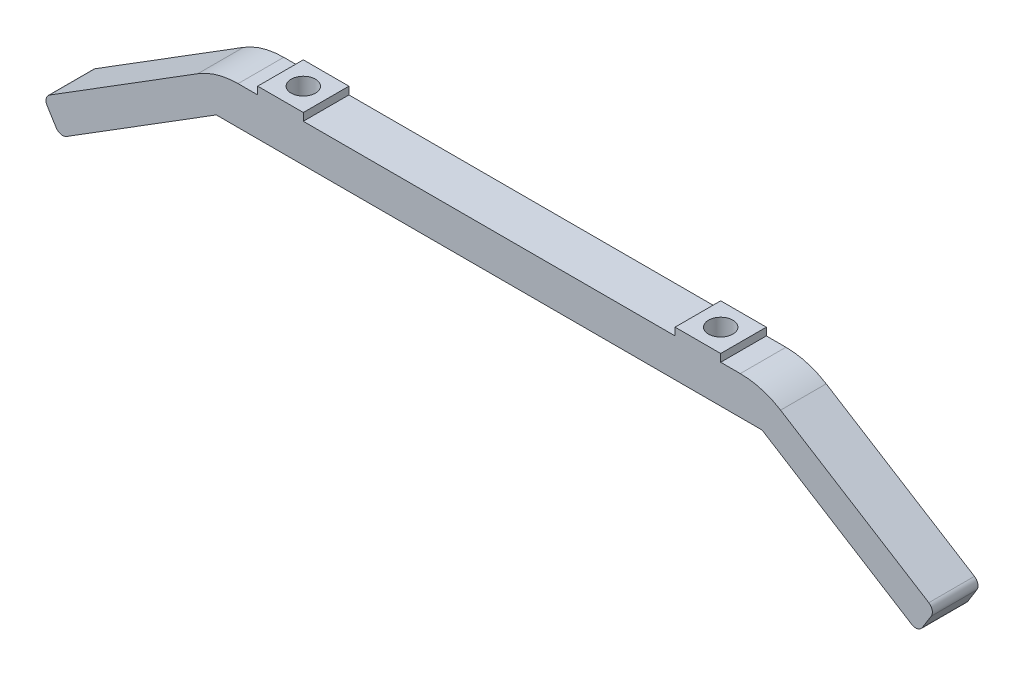
ISO-10303-21;
HEADER;
FILE_DESCRIPTION(('STEP AP214'),'2;1');
FILE_NAME('part.step','',(''),(''),'','','');
FILE_SCHEMA(('AUTOMOTIVE_DESIGN { 1 0 10303 214 1 1 1 1 }'));
ENDSEC;
DATA;
#1=APPLICATION_CONTEXT('core data for automotive mechanical design processes');
#2=APPLICATION_PROTOCOL_DEFINITION('international standard','automotive_design',2000,#1);
#3=PRODUCT_CONTEXT('',#1,'mechanical');
#4=PRODUCT('Part','Part','',(#3));
#5=PRODUCT_RELATED_PRODUCT_CATEGORY('part','',(#4));
#6=PRODUCT_DEFINITION_FORMATION('','',#4);
#7=PRODUCT_DEFINITION_CONTEXT('part definition',#1,'design');
#8=PRODUCT_DEFINITION('design','',#6,#7);
#9=PRODUCT_DEFINITION_SHAPE('','',#8);
#10=(LENGTH_UNIT() NAMED_UNIT(*) SI_UNIT(.MILLI.,.METRE.));
#11=(NAMED_UNIT(*) PLANE_ANGLE_UNIT() SI_UNIT($,.RADIAN.));
#12=(NAMED_UNIT(*) SI_UNIT($,.STERADIAN.) SOLID_ANGLE_UNIT());
#13=UNCERTAINTY_MEASURE_WITH_UNIT(LENGTH_MEASURE(1.E-05),#10,'distance_accuracy_value','');
#14=(GEOMETRIC_REPRESENTATION_CONTEXT(3) GLOBAL_UNCERTAINTY_ASSIGNED_CONTEXT((#13)) GLOBAL_UNIT_ASSIGNED_CONTEXT((#10,
#11,#12)) REPRESENTATION_CONTEXT('',''));
#15=CARTESIAN_POINT('',(0.,0.,0.));
#16=DIRECTION('',(0.,0.,1.));
#17=DIRECTION('',(1.,0.,0.));
#18=AXIS2_PLACEMENT_3D('',#15,#16,#17);
#19=CARTESIAN_POINT('',(35.8891636336118,134.664351404623,-131.106615831823));
#20=DIRECTION('',(0.529795309318727,0.848125539188554,0.));
#21=DIRECTION('',(-0.848125539188554,0.529795309318727,0.));
#22=AXIS2_PLACEMENT_3D('',#19,#20,#21);
#23=PLANE('',#22);
#24=DIRECTION('',(-0.848125539188554,0.529795309318727,0.));
#25=VECTOR('',#24,1.);
#26=CARTESIAN_POINT('',(35.8891636336118,134.664351404623,-6.43398113205662));
#27=LINE('',#26,#25);
#28=CARTESIAN_POINT('',(57.8151955530421,120.967901614889,-6.43398113205662));
#29=VERTEX_POINT('',#28);
#30=CARTESIAN_POINT('',(38.3204537318634,133.145606796509,-6.43398113205662));
#31=VERTEX_POINT('',#30);
#32=EDGE_CURVE('E223',#29,#31,#27,.T.);
#33=ORIENTED_EDGE('',*,*,#32,.F.);
#34=DIRECTION('',(0.,0.,1.));
#35=VECTOR('',#34,1.);
#36=CARTESIAN_POINT('',(57.8151955530421,120.967901614889,-131.106615831823));
#37=LINE('',#36,#35);
#38=CARTESIAN_POINT('',(57.8151955530421,120.967901614889,-12.4339811320566));
#39=VERTEX_POINT('',#38);
#40=EDGE_CURVE('E52',#29,#39,#37,.F.);
#41=ORIENTED_EDGE('',*,*,#40,.T.);
#42=DIRECTION('',(-0.848125539188554,0.529795309318727,0.));
#43=VECTOR('',#42,1.);
#44=CARTESIAN_POINT('',(35.8891636336118,134.664351404623,-12.4339811320566));
#45=LINE('',#44,#43);
#46=CARTESIAN_POINT('',(38.3204537318634,133.145606796509,-12.4339811320566));
#47=VERTEX_POINT('',#46);
#48=EDGE_CURVE('E231',#39,#47,#45,.T.);
#49=ORIENTED_EDGE('',*,*,#48,.T.);
#50=DIRECTION('',(0.,0.,1.));
#51=VECTOR('',#50,1.);
#52=CARTESIAN_POINT('',(38.3204537318634,133.145606796509,-131.106615831823));
#53=LINE('',#52,#51);
#54=EDGE_CURVE('E263',#47,#31,#53,.T.);
#55=ORIENTED_EDGE('',*,*,#54,.T.);
#56=EDGE_LOOP('',(#33,#41,#49,#55));
#57=FACE_BOUND('',#56,.T.);
#58=ADVANCED_FACE('F44',(#57),#23,.T.);
#59=CARTESIAN_POINT('',(-35.8891636336118,134.664351404623,-131.106615831823));
#60=DIRECTION('',(0.,1.,0.));
#61=DIRECTION('',(0.,0.,1.));
#62=AXIS2_PLACEMENT_3D('',#59,#60,#61);
#63=PLANE('',#62);
#64=DIRECTION('',(-1.,0.,0.));
#65=VECTOR('',#64,1.);
#66=CARTESIAN_POINT('',(-35.8891636336118,134.664351404623,-6.43398113205662));
#67=LINE('',#66,#65);
#68=CARTESIAN_POINT('',(33.0225006386761,134.664351404623,-6.43398113205662));
#69=VERTEX_POINT('',#68);
#70=CARTESIAN_POINT('',(30.4458430093025,134.664351404623,-6.43398113205662));
#71=VERTEX_POINT('',#70);
#72=EDGE_CURVE('E415',#69,#71,#67,.T.);
#73=ORIENTED_EDGE('',*,*,#72,.F.);
#74=DIRECTION('',(0.,0.,1.));
#75=VECTOR('',#74,1.);
#76=CARTESIAN_POINT('',(33.0225006386761,134.664351404623,-131.106615831823));
#77=LINE('',#76,#75);
#78=CARTESIAN_POINT('',(33.0225006386761,134.664351404623,-12.4339811320566));
#79=VERTEX_POINT('',#78);
#80=EDGE_CURVE('E266',#69,#79,#77,.F.);
#81=ORIENTED_EDGE('',*,*,#80,.T.);
#82=DIRECTION('',(-1.,0.,0.));
#83=VECTOR('',#82,1.);
#84=CARTESIAN_POINT('',(-35.8891636336118,134.664351404623,-12.4339811320566));
#85=LINE('',#84,#83);
#86=CARTESIAN_POINT('',(30.4458430093025,134.664351404623,-12.4339811320566));
#87=VERTEX_POINT('',#86);
#88=EDGE_CURVE('E244',#79,#87,#85,.T.);
#89=ORIENTED_EDGE('',*,*,#88,.T.);
#90=DIRECTION('',(0.,0.,-1.));
#91=VECTOR('',#90,1.);
#92=CARTESIAN_POINT('',(30.4458430093025,134.664351404623,-6.43398113205662));
#93=LINE('',#92,#91);
#94=EDGE_CURVE('E432',#71,#87,#93,.T.);
#95=ORIENTED_EDGE('',*,*,#94,.F.);
#96=EDGE_LOOP('',(#73,#81,#89,#95));
#97=FACE_BOUND('',#96,.T.);
#98=ADVANCED_FACE('F318',(#97),#63,.T.);
#99=CARTESIAN_POINT('',(30.4458430093025,135.664351404623,-6.43398113205662));
#100=DIRECTION('',(-1.,0.,0.));
#101=DIRECTION('',(0.,0.,1.));
#102=AXIS2_PLACEMENT_3D('',#99,#100,#101);
#103=PLANE('',#102);
#104=ORIENTED_EDGE('',*,*,#94,.T.);
#105=DIRECTION('',(0.,-1.,0.));
#106=VECTOR('',#105,1.);
#107=CARTESIAN_POINT('',(30.4458430093025,135.664351404623,-12.4339811320566));
#108=LINE('',#107,#106);
#109=CARTESIAN_POINT('',(30.4458430093025,135.664351404623,-12.4339811320566));
#110=VERTEX_POINT('',#109);
#111=EDGE_CURVE('E446',#110,#87,#108,.T.);
#112=ORIENTED_EDGE('',*,*,#111,.F.);
#113=DIRECTION('',(0.,0.,-1.));
#114=VECTOR('',#113,1.);
#115=CARTESIAN_POINT('',(30.4458430093025,135.664351404623,-6.43398113205662));
#116=LINE('',#115,#114);
#117=CARTESIAN_POINT('',(30.4458430093025,135.664351404623,-6.43398113205662));
#118=VERTEX_POINT('',#117);
#119=EDGE_CURVE('E514',#118,#110,#116,.T.);
#120=ORIENTED_EDGE('',*,*,#119,.F.);
#121=DIRECTION('',(0.,-1.,0.));
#122=VECTOR('',#121,1.);
#123=CARTESIAN_POINT('',(30.4458430093025,135.664351404623,-6.43398113205662));
#124=LINE('',#123,#122);
#125=EDGE_CURVE('E428',#118,#71,#124,.T.);
#126=ORIENTED_EDGE('',*,*,#125,.T.);
#127=EDGE_LOOP('',(#104,#112,#120,#126));
#128=FACE_BOUND('',#127,.T.);
#129=ADVANCED_FACE('F323',(#128),#103,.F.);
#130=CARTESIAN_POINT('',(24.4458430093025,135.664351404623,-6.43398113205662));
#131=DIRECTION('',(1.,0.,0.));
#132=DIRECTION('',(0.,0.,-1.));
#133=AXIS2_PLACEMENT_3D('',#130,#131,#132);
#134=PLANE('',#133);
#135=DIRECTION('',(0.,0.,1.));
#136=VECTOR('',#135,1.);
#137=CARTESIAN_POINT('',(24.4458430093025,134.664351404623,-6.43398113205662));
#138=LINE('',#137,#136);
#139=CARTESIAN_POINT('',(24.4458430093025,134.664351404623,-12.4339811320566));
#140=VERTEX_POINT('',#139);
#141=CARTESIAN_POINT('',(24.4458430093025,134.664351404623,-6.43398113205662));
#142=VERTEX_POINT('',#141);
#143=EDGE_CURVE('E392',#140,#142,#138,.T.);
#144=ORIENTED_EDGE('',*,*,#143,.T.);
#145=DIRECTION('',(0.,-1.,0.));
#146=VECTOR('',#145,1.);
#147=CARTESIAN_POINT('',(24.4458430093025,135.664351404623,-6.43398113205662));
#148=LINE('',#147,#146);
#149=CARTESIAN_POINT('',(24.4458430093025,135.664351404623,-6.43398113205662));
#150=VERTEX_POINT('',#149);
#151=EDGE_CURVE('E421',#150,#142,#148,.T.);
#152=ORIENTED_EDGE('',*,*,#151,.F.);
#153=DIRECTION('',(0.,0.,1.));
#154=VECTOR('',#153,1.);
#155=CARTESIAN_POINT('',(24.4458430093025,135.664351404623,-6.43398113205662));
#156=LINE('',#155,#154);
#157=CARTESIAN_POINT('',(24.4458430093025,135.664351404623,-12.4339811320566));
#158=VERTEX_POINT('',#157);
#159=EDGE_CURVE('E436',#158,#150,#156,.T.);
#160=ORIENTED_EDGE('',*,*,#159,.F.);
#161=DIRECTION('',(0.,-1.,0.));
#162=VECTOR('',#161,1.);
#163=CARTESIAN_POINT('',(24.4458430093025,135.664351404623,-12.4339811320566));
#164=LINE('',#163,#162);
#165=EDGE_CURVE('E431',#158,#140,#164,.T.);
#166=ORIENTED_EDGE('',*,*,#165,.T.);
#167=EDGE_LOOP('',(#144,#152,#160,#166));
#168=FACE_BOUND('',#167,.T.);
#169=ADVANCED_FACE('F430',(#168),#134,.F.);
#170=CARTESIAN_POINT('',(-24.4458430093025,134.664351404623,-6.43398113205662));
#171=VERTEX_POINT('',#170);
#172=EDGE_CURVE('E416',#142,#171,#67,.T.);
#173=ORIENTED_EDGE('',*,*,#172,.F.);
#174=ORIENTED_EDGE('',*,*,#143,.F.);
#175=CARTESIAN_POINT('',(-24.4458430093025,134.664351404623,-12.4339811320566));
#176=VERTEX_POINT('',#175);
#177=EDGE_CURVE('E246',#140,#176,#85,.T.);
#178=ORIENTED_EDGE('',*,*,#177,.T.);
#179=DIRECTION('',(0.,0.,-1.));
#180=VECTOR('',#179,1.);
#181=CARTESIAN_POINT('',(-24.4458430093025,134.664351404623,-6.43398113205662));
#182=LINE('',#181,#180);
#183=EDGE_CURVE('E389',#171,#176,#182,.T.);
#184=ORIENTED_EDGE('',*,*,#183,.F.);
#185=EDGE_LOOP('',(#173,#174,#178,#184));
#186=FACE_BOUND('',#185,.T.);
#187=ADVANCED_FACE('F327',(#186),#63,.T.);
#188=CARTESIAN_POINT('',(-24.4458430093025,135.664351404623,-6.43398113205662));
#189=DIRECTION('',(-1.,0.,0.));
#190=DIRECTION('',(0.,0.,1.));
#191=AXIS2_PLACEMENT_3D('',#188,#189,#190);
#192=PLANE('',#191);
#193=ORIENTED_EDGE('',*,*,#183,.T.);
#194=DIRECTION('',(0.,-1.,0.));
#195=VECTOR('',#194,1.);
#196=CARTESIAN_POINT('',(-24.4458430093025,135.664351404623,-12.4339811320566));
#197=LINE('',#196,#195);
#198=CARTESIAN_POINT('',(-24.4458430093025,135.664351404623,-12.4339811320566));
#199=VERTEX_POINT('',#198);
#200=EDGE_CURVE('E400',#199,#176,#197,.T.);
#201=ORIENTED_EDGE('',*,*,#200,.F.);
#202=DIRECTION('',(0.,0.,-1.));
#203=VECTOR('',#202,1.);
#204=CARTESIAN_POINT('',(-24.4458430093025,135.664351404623,-6.43398113205662));
#205=LINE('',#204,#203);
#206=CARTESIAN_POINT('',(-24.4458430093025,135.664351404623,-6.43398113205662));
#207=VERTEX_POINT('',#206);
#208=EDGE_CURVE('E457',#207,#199,#205,.T.);
#209=ORIENTED_EDGE('',*,*,#208,.F.);
#210=DIRECTION('',(0.,-1.,0.));
#211=VECTOR('',#210,1.);
#212=CARTESIAN_POINT('',(-24.4458430093025,135.664351404623,-6.43398113205662));
#213=LINE('',#212,#211);
#214=EDGE_CURVE('E226',#207,#171,#213,.T.);
#215=ORIENTED_EDGE('',*,*,#214,.T.);
#216=EDGE_LOOP('',(#193,#201,#209,#215));
#217=FACE_BOUND('',#216,.T.);
#218=ADVANCED_FACE('F398',(#217),#192,.F.);
#219=CARTESIAN_POINT('',(-30.4458430093025,135.664351404623,-6.43398113205662));
#220=DIRECTION('',(1.,0.,0.));
#221=DIRECTION('',(0.,0.,-1.));
#222=AXIS2_PLACEMENT_3D('',#219,#220,#221);
#223=PLANE('',#222);
#224=DIRECTION('',(0.,0.,1.));
#225=VECTOR('',#224,1.);
#226=CARTESIAN_POINT('',(-30.4458430093025,134.664351404623,-6.43398113205662));
#227=LINE('',#226,#225);
#228=CARTESIAN_POINT('',(-30.4458430093025,134.664351404623,-12.4339811320566));
#229=VERTEX_POINT('',#228);
#230=CARTESIAN_POINT('',(-30.4458430093025,134.664351404623,-6.43398113205662));
#231=VERTEX_POINT('',#230);
#232=EDGE_CURVE('E384',#229,#231,#227,.T.);
#233=ORIENTED_EDGE('',*,*,#232,.T.);
#234=DIRECTION('',(0.,-1.,0.));
#235=VECTOR('',#234,1.);
#236=CARTESIAN_POINT('',(-30.4458430093025,135.664351404623,-6.43398113205662));
#237=LINE('',#236,#235);
#238=CARTESIAN_POINT('',(-30.4458430093025,135.664351404623,-6.43398113205662));
#239=VERTEX_POINT('',#238);
#240=EDGE_CURVE('E220',#239,#231,#237,.T.);
#241=ORIENTED_EDGE('',*,*,#240,.F.);
#242=DIRECTION('',(0.,0.,1.));
#243=VECTOR('',#242,1.);
#244=CARTESIAN_POINT('',(-30.4458430093025,135.664351404623,-6.43398113205662));
#245=LINE('',#244,#243);
#246=CARTESIAN_POINT('',(-30.4458430093025,135.664351404623,-12.4339811320566));
#247=VERTEX_POINT('',#246);
#248=EDGE_CURVE('E403',#247,#239,#245,.T.);
#249=ORIENTED_EDGE('',*,*,#248,.F.);
#250=DIRECTION('',(0.,-1.,0.));
#251=VECTOR('',#250,1.);
#252=CARTESIAN_POINT('',(-30.4458430093025,135.664351404623,-12.4339811320566));
#253=LINE('',#252,#251);
#254=EDGE_CURVE('E406',#247,#229,#253,.T.);
#255=ORIENTED_EDGE('',*,*,#254,.T.);
#256=EDGE_LOOP('',(#233,#241,#249,#255));
#257=FACE_BOUND('',#256,.T.);
#258=ADVANCED_FACE('F462',(#257),#223,.F.);
#259=CARTESIAN_POINT('',(-33.0225006386761,134.664351404623,-12.4339811320566));
#260=VERTEX_POINT('',#259);
#261=EDGE_CURVE('E247',#229,#260,#85,.T.);
#262=ORIENTED_EDGE('',*,*,#261,.T.);
#263=DIRECTION('',(0.,0.,1.));
#264=VECTOR('',#263,1.);
#265=CARTESIAN_POINT('',(-33.0225006386761,134.664351404623,-131.106615831823));
#266=LINE('',#265,#264);
#267=CARTESIAN_POINT('',(-33.0225006386761,134.664351404623,-6.43398113205662));
#268=VERTEX_POINT('',#267);
#269=EDGE_CURVE('E233',#260,#268,#266,.T.);
#270=ORIENTED_EDGE('',*,*,#269,.T.);
#271=EDGE_CURVE('E417',#231,#268,#67,.T.);
#272=ORIENTED_EDGE('',*,*,#271,.F.);
#273=ORIENTED_EDGE('',*,*,#232,.F.);
#274=EDGE_LOOP('',(#262,#270,#272,#273));
#275=FACE_BOUND('',#274,.T.);
#276=ADVANCED_FACE('F326',(#275),#63,.T.);
#277=CARTESIAN_POINT('',(-35.8891636336118,134.664351404623,-131.106615831823));
#278=DIRECTION('',(-0.529795309318727,0.848125539188554,0.));
#279=DIRECTION('',(-0.848125539188554,-0.529795309318727,0.));
#280=AXIS2_PLACEMENT_3D('',#277,#278,#279);
#281=PLANE('',#280);
#282=DIRECTION('',(-0.848125539188554,-0.529795309318727,0.));
#283=VECTOR('',#282,1.);
#284=CARTESIAN_POINT('',(-35.8891636336118,134.664351404623,-12.4339811320566));
#285=LINE('',#284,#283);
#286=CARTESIAN_POINT('',(-38.3204537318634,133.145606796509,-12.4339811320566));
#287=VERTEX_POINT('',#286);
#288=CARTESIAN_POINT('',(-57.8151955530421,120.967901614889,-12.4339811320566));
#289=VERTEX_POINT('',#288);
#290=EDGE_CURVE('E241',#287,#289,#285,.T.);
#291=ORIENTED_EDGE('',*,*,#290,.T.);
#292=DIRECTION('',(0.,0.,1.));
#293=VECTOR('',#292,1.);
#294=CARTESIAN_POINT('',(-57.8151955530421,120.967901614889,-131.106615831823));
#295=LINE('',#294,#293);
#296=CARTESIAN_POINT('',(-57.8151955530421,120.967901614889,-6.43398113205662));
#297=VERTEX_POINT('',#296);
#298=EDGE_CURVE('E289',#289,#297,#295,.T.);
#299=ORIENTED_EDGE('',*,*,#298,.T.);
#300=DIRECTION('',(-0.848125539188554,-0.529795309318727,0.));
#301=VECTOR('',#300,1.);
#302=CARTESIAN_POINT('',(-35.8891636336118,134.664351404623,-6.43398113205662));
#303=LINE('',#302,#301);
#304=CARTESIAN_POINT('',(-38.3204537318634,133.145606796509,-6.43398113205662));
#305=VERTEX_POINT('',#304);
#306=EDGE_CURVE('E375',#305,#297,#303,.T.);
#307=ORIENTED_EDGE('',*,*,#306,.F.);
#308=DIRECTION('',(0.,0.,1.));
#309=VECTOR('',#308,1.);
#310=CARTESIAN_POINT('',(-38.3204537318634,133.145606796509,-131.106615831823));
#311=LINE('',#310,#309);
#312=EDGE_CURVE('E256',#305,#287,#311,.F.);
#313=ORIENTED_EDGE('',*,*,#312,.T.);
#314=EDGE_LOOP('',(#291,#299,#307,#313));
#315=FACE_BOUND('',#314,.T.);
#316=ADVANCED_FACE('F371',(#315),#281,.T.);
#317=CARTESIAN_POINT('',(-56.4166564303531,116.841521654451,-131.106615831823));
#318=DIRECTION('',(-0.848125539188554,-0.529795309318727,0.));
#319=DIRECTION('',(0.529795309318727,-0.848125539188554,0.));
#320=AXIS2_PLACEMENT_3D('',#317,#318,#319);
#321=PLANE('',#320);
#322=DIRECTION('',(0.529795309318727,-0.848125539188554,0.));
#323=VECTOR('',#322,1.);
#324=CARTESIAN_POINT('',(-56.4166564303531,116.841521654451,-12.4339811320566));
#325=LINE('',#324,#323);
#326=CARTESIAN_POINT('',(-58.1335257829119,119.589980766382,-12.4339811320566));
#327=VERTEX_POINT('',#326);
#328=CARTESIAN_POINT('',(-56.9464517396718,117.68964719364,-12.4339811320566));
#329=VERTEX_POINT('',#328);
#330=EDGE_CURVE('E238',#327,#329,#325,.T.);
#331=ORIENTED_EDGE('',*,*,#330,.T.);
#332=DIRECTION('',(0.,0.,1.));
#333=VECTOR('',#332,1.);
#334=CARTESIAN_POINT('',(-56.9464517396718,117.68964719364,-131.106615831823));
#335=LINE('',#334,#333);
#336=CARTESIAN_POINT('',(-56.9464517396718,117.68964719364,-6.43398113205662));
#337=VERTEX_POINT('',#336);
#338=EDGE_CURVE('E270',#329,#337,#335,.T.);
#339=ORIENTED_EDGE('',*,*,#338,.T.);
#340=DIRECTION('',(0.529795309318727,-0.848125539188554,0.));
#341=VECTOR('',#340,1.);
#342=CARTESIAN_POINT('',(-56.4166564303531,116.841521654451,-6.43398113205662));
#343=LINE('',#342,#341);
#344=CARTESIAN_POINT('',(-58.1335257829119,119.589980766382,-6.43398113205662));
#345=VERTEX_POINT('',#344);
#346=EDGE_CURVE('E412',#345,#337,#343,.T.);
#347=ORIENTED_EDGE('',*,*,#346,.F.);
#348=DIRECTION('',(0.,0.,1.));
#349=VECTOR('',#348,1.);
#350=CARTESIAN_POINT('',(-58.1335257829119,119.589980766382,-131.106615831823));
#351=LINE('',#350,#349);
#352=EDGE_CURVE('E268',#345,#327,#351,.F.);
#353=ORIENTED_EDGE('',*,*,#352,.T.);
#354=EDGE_LOOP('',(#331,#339,#347,#353));
#355=FACE_BOUND('',#354,.T.);
#356=ADVANCED_FACE('F332',(#355),#321,.T.);
#357=CARTESIAN_POINT('',(56.4166564303531,116.841521654451,-131.106615831823));
#358=DIRECTION('',(0.848125539188554,-0.529795309318727,0.));
#359=DIRECTION('',(0.529795309318727,0.848125539188554,0.));
#360=AXIS2_PLACEMENT_3D('',#357,#358,#359);
#361=PLANE('',#360);
#362=DIRECTION('',(0.529795309318727,0.848125539188554,0.));
#363=VECTOR('',#362,1.);
#364=CARTESIAN_POINT('',(56.4166564303531,116.841521654451,-12.4339811320566));
#365=LINE('',#364,#363);
#366=CARTESIAN_POINT('',(56.9464517396718,117.68964719364,-12.4339811320566));
#367=VERTEX_POINT('',#366);
#368=CARTESIAN_POINT('',(58.1335257829119,119.589980766382,-12.4339811320566));
#369=VERTEX_POINT('',#368);
#370=EDGE_CURVE('E206',#367,#369,#365,.T.);
#371=ORIENTED_EDGE('',*,*,#370,.T.);
#372=DIRECTION('',(0.,0.,1.));
#373=VECTOR('',#372,1.);
#374=CARTESIAN_POINT('',(58.1335257829119,119.589980766382,-131.106615831823));
#375=LINE('',#374,#373);
#376=CARTESIAN_POINT('',(58.1335257829119,119.589980766382,-6.43398113205662));
#377=VERTEX_POINT('',#376);
#378=EDGE_CURVE('E294',#369,#377,#375,.T.);
#379=ORIENTED_EDGE('',*,*,#378,.T.);
#380=DIRECTION('',(0.529795309318727,0.848125539188554,0.));
#381=VECTOR('',#380,1.);
#382=CARTESIAN_POINT('',(56.4166564303531,116.841521654451,-6.43398113205662));
#383=LINE('',#382,#381);
#384=CARTESIAN_POINT('',(56.9464517396718,117.68964719364,-6.43398113205662));
#385=VERTEX_POINT('',#384);
#386=EDGE_CURVE('E219',#385,#377,#383,.T.);
#387=ORIENTED_EDGE('',*,*,#386,.F.);
#388=DIRECTION('',(0.,0.,1.));
#389=VECTOR('',#388,1.);
#390=CARTESIAN_POINT('',(56.9464517396718,117.68964719364,-131.106615831823));
#391=LINE('',#390,#389);
#392=EDGE_CURVE('E292',#385,#367,#391,.F.);
#393=ORIENTED_EDGE('',*,*,#392,.T.);
#394=EDGE_LOOP('',(#371,#379,#387,#393));
#395=FACE_BOUND('',#394,.T.);
#396=ADVANCED_FACE('F309',(#395),#361,.T.);
#397=CARTESIAN_POINT('',(-35.8891636336118,129.664351404623,-131.106615831823));
#398=DIRECTION('',(0.,-1.,0.));
#399=DIRECTION('',(0.,0.,-1.));
#400=AXIS2_PLACEMENT_3D('',#397,#398,#399);
#401=PLANE('',#400);
#402=DIRECTION('',(0.,0.,1.));
#403=VECTOR('',#402,1.);
#404=CARTESIAN_POINT('',(-35.8891636336118,129.664351404623,-131.106615831823));
#405=LINE('',#404,#403);
#406=CARTESIAN_POINT('',(-35.8891636336118,129.664351404623,-12.4339811320566));
#407=VERTEX_POINT('',#406);
#408=CARTESIAN_POINT('',(-35.8891636336118,129.664351404623,-6.43398113205662));
#409=VERTEX_POINT('',#408);
#410=EDGE_CURVE('E235',#407,#409,#405,.T.);
#411=ORIENTED_EDGE('',*,*,#410,.F.);
#412=DIRECTION('',(1.,0.,0.));
#413=VECTOR('',#412,1.);
#414=CARTESIAN_POINT('',(-35.8891636336118,129.664351404623,-12.4339811320566));
#415=LINE('',#414,#413);
#416=CARTESIAN_POINT('',(35.8891636336118,129.664351404623,-12.4339811320566));
#417=VERTEX_POINT('',#416);
#418=EDGE_CURVE('E213',#407,#417,#415,.T.);
#419=ORIENTED_EDGE('',*,*,#418,.T.);
#420=DIRECTION('',(0.,0.,1.));
#421=VECTOR('',#420,1.);
#422=CARTESIAN_POINT('',(35.8891636336118,129.664351404623,-131.106615831823));
#423=LINE('',#422,#421);
#424=CARTESIAN_POINT('',(35.8891636336118,129.664351404623,-6.43398113205665));
#425=VERTEX_POINT('',#424);
#426=EDGE_CURVE('E209',#417,#425,#423,.T.);
#427=ORIENTED_EDGE('',*,*,#426,.T.);
#428=DIRECTION('',(1.,0.,0.));
#429=VECTOR('',#428,1.);
#430=CARTESIAN_POINT('',(-35.8891636336118,129.664351404623,-6.43398113205662));
#431=LINE('',#430,#429);
#432=EDGE_CURVE('E195',#409,#425,#431,.T.);
#433=ORIENTED_EDGE('',*,*,#432,.F.);
#434=EDGE_LOOP('',(#411,#419,#427,#433));
#435=FACE_BOUND('',#434,.T.);
#436=CARTESIAN_POINT('',(-27.4458430093025,129.664351404623,-9.43398113205662));
#437=DIRECTION('',(0.,1.,0.));
#438=DIRECTION('',(0.,0.,1.));
#439=AXIS2_PLACEMENT_3D('',#436,#437,#438);
#440=CIRCLE('',#439,1.6);
#441=CARTESIAN_POINT('',(-27.4458430093025,129.664351404623,-7.83398113205661));
#442=VERTEX_POINT('',#441);
#443=EDGE_CURVE('E439',#442,#442,#440,.F.);
#444=ORIENTED_EDGE('',*,*,#443,.F.);
#445=EDGE_LOOP('',(#444));
#446=FACE_BOUND('',#445,.T.);
#447=CARTESIAN_POINT('',(27.4458430093025,129.664351404623,-9.43398113205662));
#448=DIRECTION('',(0.,1.,0.));
#449=DIRECTION('',(0.,0.,1.));
#450=AXIS2_PLACEMENT_3D('',#447,#448,#449);
#451=CIRCLE('',#450,1.6);
#452=CARTESIAN_POINT('',(27.4458430093025,129.664351404623,-7.83398113205661));
#453=VERTEX_POINT('',#452);
#454=EDGE_CURVE('E524',#453,#453,#451,.F.);
#455=ORIENTED_EDGE('',*,*,#454,.F.);
#456=EDGE_LOOP('',(#455));
#457=FACE_BOUND('',#456,.T.);
#458=ADVANCED_FACE('F210',(#435,#446,#457),#401,.T.);
#459=CARTESIAN_POINT('',(35.8891636336118,129.664351404623,-131.106615831823));
#460=DIRECTION('',(-0.529795309318727,-0.848125539188554,0.));
#461=DIRECTION('',(0.848125539188554,-0.529795309318727,0.));
#462=AXIS2_PLACEMENT_3D('',#459,#460,#461);
#463=PLANE('',#462);
#464=DIRECTION('',(0.848125539188554,-0.529795309318727,0.));
#465=VECTOR('',#464,1.);
#466=CARTESIAN_POINT('',(35.8891636336118,129.664351404623,-12.4339811320566));
#467=LINE('',#466,#465);
#468=CARTESIAN_POINT('',(55.5685308911645,117.37131696377,-12.4339811320566));
#469=VERTEX_POINT('',#468);
#470=EDGE_CURVE('E215',#417,#469,#467,.T.);
#471=ORIENTED_EDGE('',*,*,#470,.T.);
#472=DIRECTION('',(0.,0.,1.));
#473=VECTOR('',#472,1.);
#474=CARTESIAN_POINT('',(55.5685308911645,117.37131696377,-131.106615831823));
#475=LINE('',#474,#473);
#476=CARTESIAN_POINT('',(55.5685308911645,117.37131696377,-6.43398113205662));
#477=VERTEX_POINT('',#476);
#478=EDGE_CURVE('E12',#469,#477,#475,.T.);
#479=ORIENTED_EDGE('',*,*,#478,.T.);
#480=DIRECTION('',(0.848125539188554,-0.529795309318727,0.));
#481=VECTOR('',#480,1.);
#482=CARTESIAN_POINT('',(35.8891636336118,129.664351404623,-6.43398113205662));
#483=LINE('',#482,#481);
#484=EDGE_CURVE('E200',#425,#477,#483,.T.);
#485=ORIENTED_EDGE('',*,*,#484,.F.);
#486=ORIENTED_EDGE('',*,*,#426,.F.);
#487=EDGE_LOOP('',(#471,#479,#485,#486));
#488=FACE_BOUND('',#487,.T.);
#489=ADVANCED_FACE('F217',(#488),#463,.T.);
#490=CARTESIAN_POINT('',(-35.8891636336118,129.664351404623,-131.106615831823));
#491=DIRECTION('',(0.529795309318727,-0.848125539188554,0.));
#492=DIRECTION('',(0.848125539188554,0.529795309318727,0.));
#493=AXIS2_PLACEMENT_3D('',#490,#491,#492);
#494=PLANE('',#493);
#495=DIRECTION('',(0.848125539188554,0.529795309318727,0.));
#496=VECTOR('',#495,1.);
#497=CARTESIAN_POINT('',(-35.8891636336118,129.664351404623,-6.43398113205662));
#498=LINE('',#497,#496);
#499=CARTESIAN_POINT('',(-55.5685308911645,117.37131696377,-6.43398113205662));
#500=VERTEX_POINT('',#499);
#501=EDGE_CURVE('E202',#500,#409,#498,.T.);
#502=ORIENTED_EDGE('',*,*,#501,.F.);
#503=DIRECTION('',(0.,0.,1.));
#504=VECTOR('',#503,1.);
#505=CARTESIAN_POINT('',(-55.5685308911645,117.37131696377,-131.106615831823));
#506=LINE('',#505,#504);
#507=CARTESIAN_POINT('',(-55.5685308911645,117.37131696377,-12.4339811320566));
#508=VERTEX_POINT('',#507);
#509=EDGE_CURVE('E281',#500,#508,#506,.F.);
#510=ORIENTED_EDGE('',*,*,#509,.T.);
#511=DIRECTION('',(0.848125539188554,0.529795309318727,0.));
#512=VECTOR('',#511,1.);
#513=CARTESIAN_POINT('',(-35.8891636336118,129.664351404623,-12.4339811320566));
#514=LINE('',#513,#512);
#515=EDGE_CURVE('E236',#508,#407,#514,.T.);
#516=ORIENTED_EDGE('',*,*,#515,.T.);
#517=ORIENTED_EDGE('',*,*,#410,.T.);
#518=EDGE_LOOP('',(#502,#510,#516,#517));
#519=FACE_BOUND('',#518,.T.);
#520=ADVANCED_FACE('F346',(#519),#494,.T.);
#521=CARTESIAN_POINT('',(-29.8891636336118,116.854443774836,-12.4339811320566));
#522=DIRECTION('',(0.,0.,-1.));
#523=DIRECTION('',(-1.,0.,0.));
#524=AXIS2_PLACEMENT_3D('',#521,#522,#523);
#525=PLANE('',#524);
#526=ORIENTED_EDGE('',*,*,#515,.F.);
#527=CARTESIAN_POINT('',(-56.0983262004833,118.219442502959,-12.4339811320566));
#528=DIRECTION('',(0.,0.,-1.));
#529=DIRECTION('',(-1.,0.,0.));
#530=AXIS2_PLACEMENT_3D('',#527,#528,#529);
#531=CIRCLE('',#530,1.);
#532=EDGE_CURVE('E287',#508,#329,#531,.T.);
#533=ORIENTED_EDGE('',*,*,#532,.T.);
#534=ORIENTED_EDGE('',*,*,#330,.F.);
#535=CARTESIAN_POINT('',(-57.2854002437234,120.119776075701,-12.4339811320566));
#536=DIRECTION('',(0.,0.,-1.));
#537=DIRECTION('',(-1.,0.,0.));
#538=AXIS2_PLACEMENT_3D('',#535,#536,#537);
#539=CIRCLE('',#538,1.);
#540=EDGE_CURVE('E285',#327,#289,#539,.T.);
#541=ORIENTED_EDGE('',*,*,#540,.T.);
#542=ORIENTED_EDGE('',*,*,#290,.F.);
#543=CARTESIAN_POINT('',(-33.0225006386761,124.664351404623,-12.4339811320566));
#544=DIRECTION('',(0.,0.,-1.));
#545=DIRECTION('',(-1.,0.,0.));
#546=AXIS2_PLACEMENT_3D('',#543,#544,#545);
#547=CIRCLE('',#546,10.);
#548=EDGE_CURVE('E261',#287,#260,#547,.T.);
#549=ORIENTED_EDGE('',*,*,#548,.T.);
#550=ORIENTED_EDGE('',*,*,#261,.F.);
#551=ORIENTED_EDGE('',*,*,#254,.F.);
#552=DIRECTION('',(-1.,0.,0.));
#553=VECTOR('',#552,1.);
#554=CARTESIAN_POINT('',(-24.4458430093025,135.664351404623,-12.4339811320566));
#555=LINE('',#554,#553);
#556=EDGE_CURVE('E405',#199,#247,#555,.T.);
#557=ORIENTED_EDGE('',*,*,#556,.F.);
#558=ORIENTED_EDGE('',*,*,#200,.T.);
#559=ORIENTED_EDGE('',*,*,#177,.F.);
#560=ORIENTED_EDGE('',*,*,#165,.F.);
#561=DIRECTION('',(-1.,0.,0.));
#562=VECTOR('',#561,1.);
#563=CARTESIAN_POINT('',(30.4458430093025,135.664351404623,-12.4339811320566));
#564=LINE('',#563,#562);
#565=EDGE_CURVE('E442',#110,#158,#564,.T.);
#566=ORIENTED_EDGE('',*,*,#565,.F.);
#567=ORIENTED_EDGE('',*,*,#111,.T.);
#568=ORIENTED_EDGE('',*,*,#88,.F.);
#569=CARTESIAN_POINT('',(33.0225006386761,124.664351404623,-12.4339811320566));
#570=DIRECTION('',(0.,0.,-1.));
#571=DIRECTION('',(-1.,0.,0.));
#572=AXIS2_PLACEMENT_3D('',#569,#570,#571);
#573=CIRCLE('',#572,10.);
#574=EDGE_CURVE('E258',#79,#47,#573,.T.);
#575=ORIENTED_EDGE('',*,*,#574,.T.);
#576=ORIENTED_EDGE('',*,*,#48,.F.);
#577=CARTESIAN_POINT('',(57.2854002437234,120.119776075701,-12.4339811320566));
#578=DIRECTION('',(0.,0.,-1.));
#579=DIRECTION('',(-1.,0.,0.));
#580=AXIS2_PLACEMENT_3D('',#577,#578,#579);
#581=CIRCLE('',#580,1.);
#582=EDGE_CURVE('E65',#39,#369,#581,.T.);
#583=ORIENTED_EDGE('',*,*,#582,.T.);
#584=ORIENTED_EDGE('',*,*,#370,.F.);
#585=CARTESIAN_POINT('',(56.0983262004833,118.219442502959,-12.4339811320566));
#586=DIRECTION('',(0.,0.,-1.));
#587=DIRECTION('',(-1.,0.,0.));
#588=AXIS2_PLACEMENT_3D('',#585,#586,#587);
#589=CIRCLE('',#588,1.);
#590=EDGE_CURVE('E59',#367,#469,#589,.T.);
#591=ORIENTED_EDGE('',*,*,#590,.T.);
#592=ORIENTED_EDGE('',*,*,#470,.F.);
#593=ORIENTED_EDGE('',*,*,#418,.F.);
#594=EDGE_LOOP('',(#526,#533,#534,#541,#542,#549,#550,#551,#557,#558,#559,#560,#566,#567,#568,
#575,#576,#583,#584,#591,#592,#593));
#595=FACE_BOUND('',#594,.T.);
#596=ADVANCED_FACE('F301',(#595),#525,.T.);
#597=CARTESIAN_POINT('',(-29.8891636336118,116.854443774836,-6.43398113205662));
#598=DIRECTION('',(0.,0.,1.));
#599=DIRECTION('',(1.,0.,0.));
#600=AXIS2_PLACEMENT_3D('',#597,#598,#599);
#601=PLANE('',#600);
#602=ORIENTED_EDGE('',*,*,#346,.T.);
#603=CARTESIAN_POINT('',(-56.0983262004833,118.219442502959,-6.43398113205662));
#604=DIRECTION('',(0.,0.,1.));
#605=DIRECTION('',(1.,0.,0.));
#606=AXIS2_PLACEMENT_3D('',#603,#604,#605);
#607=CIRCLE('',#606,1.);
#608=EDGE_CURVE('E279',#337,#500,#607,.T.);
#609=ORIENTED_EDGE('',*,*,#608,.T.);
#610=ORIENTED_EDGE('',*,*,#501,.T.);
#611=ORIENTED_EDGE('',*,*,#432,.T.);
#612=ORIENTED_EDGE('',*,*,#484,.T.);
#613=CARTESIAN_POINT('',(56.0983262004833,118.219442502959,-6.43398113205662));
#614=DIRECTION('',(0.,0.,1.));
#615=DIRECTION('',(1.,0.,0.));
#616=AXIS2_PLACEMENT_3D('',#613,#614,#615);
#617=CIRCLE('',#616,1.);
#618=EDGE_CURVE('E273',#477,#385,#617,.T.);
#619=ORIENTED_EDGE('',*,*,#618,.T.);
#620=ORIENTED_EDGE('',*,*,#386,.T.);
#621=CARTESIAN_POINT('',(57.2854002437234,120.119776075701,-6.43398113205662));
#622=DIRECTION('',(0.,0.,1.));
#623=DIRECTION('',(1.,0.,0.));
#624=AXIS2_PLACEMENT_3D('',#621,#622,#623);
#625=CIRCLE('',#624,1.);
#626=EDGE_CURVE('E275',#377,#29,#625,.T.);
#627=ORIENTED_EDGE('',*,*,#626,.T.);
#628=ORIENTED_EDGE('',*,*,#32,.T.);
#629=CARTESIAN_POINT('',(33.0225006386761,124.664351404623,-6.43398113205662));
#630=DIRECTION('',(0.,0.,1.));
#631=DIRECTION('',(1.,0.,0.));
#632=AXIS2_PLACEMENT_3D('',#629,#630,#631);
#633=CIRCLE('',#632,10.);
#634=EDGE_CURVE('E252',#31,#69,#633,.T.);
#635=ORIENTED_EDGE('',*,*,#634,.T.);
#636=ORIENTED_EDGE('',*,*,#72,.T.);
#637=ORIENTED_EDGE('',*,*,#125,.F.);
#638=DIRECTION('',(1.,0.,0.));
#639=VECTOR('',#638,1.);
#640=CARTESIAN_POINT('',(30.4458430093025,135.664351404623,-6.43398113205662));
#641=LINE('',#640,#639);
#642=EDGE_CURVE('E423',#150,#118,#641,.T.);
#643=ORIENTED_EDGE('',*,*,#642,.F.);
#644=ORIENTED_EDGE('',*,*,#151,.T.);
#645=ORIENTED_EDGE('',*,*,#172,.T.);
#646=ORIENTED_EDGE('',*,*,#214,.F.);
#647=DIRECTION('',(1.,0.,0.));
#648=VECTOR('',#647,1.);
#649=CARTESIAN_POINT('',(-24.4458430093025,135.664351404623,-6.43398113205662));
#650=LINE('',#649,#648);
#651=EDGE_CURVE('E455',#239,#207,#650,.T.);
#652=ORIENTED_EDGE('',*,*,#651,.F.);
#653=ORIENTED_EDGE('',*,*,#240,.T.);
#654=ORIENTED_EDGE('',*,*,#271,.T.);
#655=CARTESIAN_POINT('',(-33.0225006386761,124.664351404623,-6.43398113205662));
#656=DIRECTION('',(0.,0.,1.));
#657=DIRECTION('',(1.,0.,0.));
#658=AXIS2_PLACEMENT_3D('',#655,#656,#657);
#659=CIRCLE('',#658,10.);
#660=EDGE_CURVE('E254',#268,#305,#659,.T.);
#661=ORIENTED_EDGE('',*,*,#660,.T.);
#662=ORIENTED_EDGE('',*,*,#306,.T.);
#663=CARTESIAN_POINT('',(-57.2854002437234,120.119776075701,-6.43398113205662));
#664=DIRECTION('',(0.,0.,1.));
#665=DIRECTION('',(1.,0.,0.));
#666=AXIS2_PLACEMENT_3D('',#663,#664,#665);
#667=CIRCLE('',#666,1.);
#668=EDGE_CURVE('E277',#297,#345,#667,.T.);
#669=ORIENTED_EDGE('',*,*,#668,.T.);
#670=EDGE_LOOP('',(#602,#609,#610,#611,#612,#619,#620,#627,#628,#635,#636,#637,#643,#644,#645,
#646,#652,#653,#654,#661,#662,#669));
#671=FACE_BOUND('',#670,.T.);
#672=ADVANCED_FACE('F198',(#671),#601,.T.);
#673=CARTESIAN_POINT('',(0.,135.664351404623,0.));
#674=DIRECTION('',(0.,1.,0.));
#675=DIRECTION('',(0.,0.,1.));
#676=AXIS2_PLACEMENT_3D('',#673,#674,#675);
#677=PLANE('',#676);
#678=ORIENTED_EDGE('',*,*,#159,.T.);
#679=ORIENTED_EDGE('',*,*,#642,.T.);
#680=ORIENTED_EDGE('',*,*,#119,.T.);
#681=ORIENTED_EDGE('',*,*,#565,.T.);
#682=EDGE_LOOP('',(#678,#679,#680,#681));
#683=FACE_BOUND('',#682,.T.);
#684=CARTESIAN_POINT('',(27.4458430093025,135.664351404623,-9.43398113205662));
#685=DIRECTION('',(0.,1.,0.));
#686=DIRECTION('',(0.,0.,1.));
#687=AXIS2_PLACEMENT_3D('',#684,#685,#686);
#688=CIRCLE('',#687,1.6);
#689=CARTESIAN_POINT('',(27.4458430093025,135.664351404623,-7.83398113205661));
#690=VERTEX_POINT('',#689);
#691=EDGE_CURVE('E433',#690,#690,#688,.T.);
#692=ORIENTED_EDGE('',*,*,#691,.F.);
#693=EDGE_LOOP('',(#692));
#694=FACE_BOUND('',#693,.T.);
#695=ADVANCED_FACE('F342',(#683,#694),#677,.T.);
#696=CARTESIAN_POINT('',(27.4458430093025,79.6643514046231,-9.43398113205662));
#697=DIRECTION('',(0.,1.,0.));
#698=DIRECTION('',(0.,0.,1.));
#699=AXIS2_PLACEMENT_3D('',#696,#697,#698);
#700=CYLINDRICAL_SURFACE('',#699,1.6);
#701=ORIENTED_EDGE('',*,*,#454,.T.);
#702=EDGE_LOOP('',(#701));
#703=FACE_BOUND('',#702,.T.);
#704=ORIENTED_EDGE('',*,*,#691,.T.);
#705=EDGE_LOOP('',(#704));
#706=FACE_BOUND('',#705,.T.);
#707=ADVANCED_FACE('F339',(#703,#706),#700,.F.);
#708=CARTESIAN_POINT('',(0.,135.664351404623,0.));
#709=DIRECTION('',(0.,1.,0.));
#710=DIRECTION('',(0.,0.,1.));
#711=AXIS2_PLACEMENT_3D('',#708,#709,#710);
#712=PLANE('',#711);
#713=ORIENTED_EDGE('',*,*,#248,.T.);
#714=ORIENTED_EDGE('',*,*,#651,.T.);
#715=ORIENTED_EDGE('',*,*,#208,.T.);
#716=ORIENTED_EDGE('',*,*,#556,.T.);
#717=EDGE_LOOP('',(#713,#714,#715,#716));
#718=FACE_BOUND('',#717,.T.);
#719=CARTESIAN_POINT('',(-27.4458430093025,135.664351404623,-9.43398113205662));
#720=DIRECTION('',(0.,1.,0.));
#721=DIRECTION('',(0.,0.,1.));
#722=AXIS2_PLACEMENT_3D('',#719,#720,#721);
#723=CIRCLE('',#722,1.6);
#724=CARTESIAN_POINT('',(-27.4458430093025,135.664351404623,-7.83398113205661));
#725=VERTEX_POINT('',#724);
#726=EDGE_CURVE('E427',#725,#725,#723,.T.);
#727=ORIENTED_EDGE('',*,*,#726,.F.);
#728=EDGE_LOOP('',(#727));
#729=FACE_BOUND('',#728,.T.);
#730=ADVANCED_FACE('F337',(#718,#729),#712,.T.);
#731=CARTESIAN_POINT('',(-27.4458430093025,79.6643514046231,-9.43398113205662));
#732=DIRECTION('',(0.,1.,0.));
#733=DIRECTION('',(0.,0.,1.));
#734=AXIS2_PLACEMENT_3D('',#731,#732,#733);
#735=CYLINDRICAL_SURFACE('',#734,1.6);
#736=ORIENTED_EDGE('',*,*,#443,.T.);
#737=EDGE_LOOP('',(#736));
#738=FACE_BOUND('',#737,.T.);
#739=ORIENTED_EDGE('',*,*,#726,.T.);
#740=EDGE_LOOP('',(#739));
#741=FACE_BOUND('',#740,.T.);
#742=ADVANCED_FACE('F333',(#738,#741),#735,.F.);
#743=CARTESIAN_POINT('',(-33.0225006386761,124.664351404623,-131.106615831823));
#744=DIRECTION('',(0.,0.,1.));
#745=DIRECTION('',(1.,0.,0.));
#746=AXIS2_PLACEMENT_3D('',#743,#744,#745);
#747=CYLINDRICAL_SURFACE('',#746,10.);
#748=ORIENTED_EDGE('',*,*,#548,.F.);
#749=ORIENTED_EDGE('',*,*,#312,.F.);
#750=ORIENTED_EDGE('',*,*,#660,.F.);
#751=ORIENTED_EDGE('',*,*,#269,.F.);
#752=EDGE_LOOP('',(#748,#749,#750,#751));
#753=FACE_BOUND('',#752,.T.);
#754=ADVANCED_FACE('F336',(#753),#747,.T.);
#755=CARTESIAN_POINT('',(33.0225006386761,124.664351404623,-131.106615831823));
#756=DIRECTION('',(0.,0.,1.));
#757=DIRECTION('',(1.,0.,0.));
#758=AXIS2_PLACEMENT_3D('',#755,#756,#757);
#759=CYLINDRICAL_SURFACE('',#758,10.);
#760=ORIENTED_EDGE('',*,*,#574,.F.);
#761=ORIENTED_EDGE('',*,*,#80,.F.);
#762=ORIENTED_EDGE('',*,*,#634,.F.);
#763=ORIENTED_EDGE('',*,*,#54,.F.);
#764=EDGE_LOOP('',(#760,#761,#762,#763));
#765=FACE_BOUND('',#764,.T.);
#766=ADVANCED_FACE('F351',(#765),#759,.T.);
#767=CARTESIAN_POINT('',(-56.0983262004833,118.219442502959,-131.106615831823));
#768=DIRECTION('',(0.,0.,1.));
#769=DIRECTION('',(1.,0.,0.));
#770=AXIS2_PLACEMENT_3D('',#767,#768,#769);
#771=CYLINDRICAL_SURFACE('',#770,1.);
#772=ORIENTED_EDGE('',*,*,#532,.F.);
#773=ORIENTED_EDGE('',*,*,#509,.F.);
#774=ORIENTED_EDGE('',*,*,#608,.F.);
#775=ORIENTED_EDGE('',*,*,#338,.F.);
#776=EDGE_LOOP('',(#772,#773,#774,#775));
#777=FACE_BOUND('',#776,.T.);
#778=ADVANCED_FACE('F355',(#777),#771,.T.);
#779=CARTESIAN_POINT('',(-57.2854002437234,120.119776075701,-131.106615831823));
#780=DIRECTION('',(0.,0.,1.));
#781=DIRECTION('',(1.,0.,0.));
#782=AXIS2_PLACEMENT_3D('',#779,#780,#781);
#783=CYLINDRICAL_SURFACE('',#782,1.);
#784=ORIENTED_EDGE('',*,*,#540,.F.);
#785=ORIENTED_EDGE('',*,*,#352,.F.);
#786=ORIENTED_EDGE('',*,*,#668,.F.);
#787=ORIENTED_EDGE('',*,*,#298,.F.);
#788=EDGE_LOOP('',(#784,#785,#786,#787));
#789=FACE_BOUND('',#788,.T.);
#790=ADVANCED_FACE('F316',(#789),#783,.T.);
#791=CARTESIAN_POINT('',(57.2854002437234,120.119776075701,-131.106615831823));
#792=DIRECTION('',(0.,0.,1.));
#793=DIRECTION('',(1.,0.,0.));
#794=AXIS2_PLACEMENT_3D('',#791,#792,#793);
#795=CYLINDRICAL_SURFACE('',#794,1.);
#796=ORIENTED_EDGE('',*,*,#582,.F.);
#797=ORIENTED_EDGE('',*,*,#40,.F.);
#798=ORIENTED_EDGE('',*,*,#626,.F.);
#799=ORIENTED_EDGE('',*,*,#378,.F.);
#800=EDGE_LOOP('',(#796,#797,#798,#799));
#801=FACE_BOUND('',#800,.T.);
#802=ADVANCED_FACE('F306',(#801),#795,.T.);
#803=CARTESIAN_POINT('',(56.0983262004833,118.219442502959,-131.106615831823));
#804=DIRECTION('',(0.,0.,1.));
#805=DIRECTION('',(1.,0.,0.));
#806=AXIS2_PLACEMENT_3D('',#803,#804,#805);
#807=CYLINDRICAL_SURFACE('',#806,1.);
#808=ORIENTED_EDGE('',*,*,#590,.F.);
#809=ORIENTED_EDGE('',*,*,#392,.F.);
#810=ORIENTED_EDGE('',*,*,#618,.F.);
#811=ORIENTED_EDGE('',*,*,#478,.F.);
#812=EDGE_LOOP('',(#808,#809,#810,#811));
#813=FACE_BOUND('',#812,.T.);
#814=ADVANCED_FACE('F46',(#813),#807,.T.);
#815=CLOSED_SHELL('',(#58,#98,#129,#169,#187,#218,#258,#276,#316,#356,#396,#458,#489,#520,#596,
#672,#695,#707,#730,#742,#754,#766,#778,#790,#802,#814));
#816=MANIFOLD_SOLID_BREP('B2',#815);
#817=ADVANCED_BREP_SHAPE_REPRESENTATION('',(#18,#816),#14);
#818=SHAPE_DEFINITION_REPRESENTATION(#9,#817);
ENDSEC;
END-ISO-10303-21;
